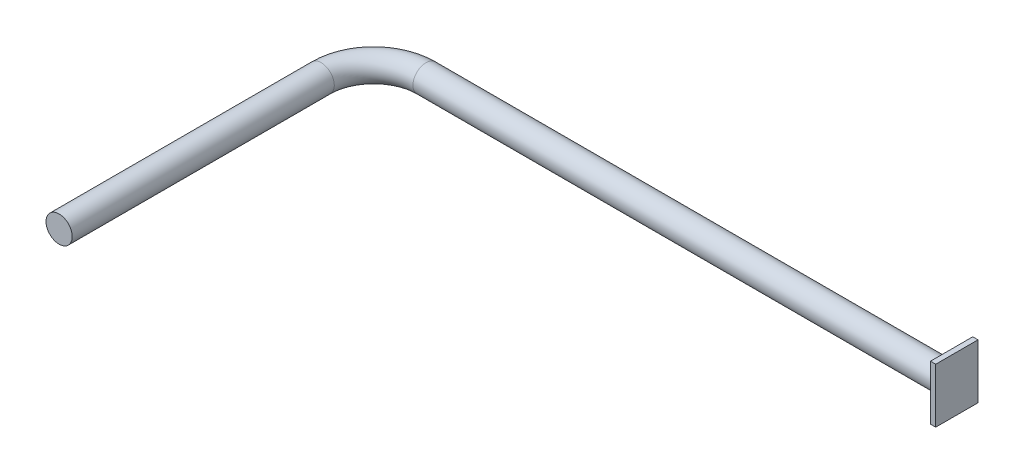
ISO-10303-21;
HEADER;
FILE_DESCRIPTION(('STEP AP214'),'2;1');
FILE_NAME('part.step','',(''),(''),'','','');
FILE_SCHEMA(('AUTOMOTIVE_DESIGN { 1 0 10303 214 1 1 1 1 }'));
ENDSEC;
DATA;
#1=APPLICATION_CONTEXT('core data for automotive mechanical design processes');
#2=APPLICATION_PROTOCOL_DEFINITION('international standard','automotive_design',2000,#1);
#3=PRODUCT_CONTEXT('',#1,'mechanical');
#4=PRODUCT('Part','Part','',(#3));
#5=PRODUCT_RELATED_PRODUCT_CATEGORY('part','',(#4));
#6=PRODUCT_DEFINITION_FORMATION('','',#4);
#7=PRODUCT_DEFINITION_CONTEXT('part definition',#1,'design');
#8=PRODUCT_DEFINITION('design','',#6,#7);
#9=PRODUCT_DEFINITION_SHAPE('','',#8);
#10=(LENGTH_UNIT() NAMED_UNIT(*) SI_UNIT(.MILLI.,.METRE.));
#11=(NAMED_UNIT(*) PLANE_ANGLE_UNIT() SI_UNIT($,.RADIAN.));
#12=(NAMED_UNIT(*) SI_UNIT($,.STERADIAN.) SOLID_ANGLE_UNIT());
#13=UNCERTAINTY_MEASURE_WITH_UNIT(LENGTH_MEASURE(1.E-05),#10,'distance_accuracy_value','');
#14=(GEOMETRIC_REPRESENTATION_CONTEXT(3) GLOBAL_UNCERTAINTY_ASSIGNED_CONTEXT((#13)) GLOBAL_UNIT_ASSIGNED_CONTEXT((#10,
#11,#12)) REPRESENTATION_CONTEXT('',''));
#15=CARTESIAN_POINT('',(0.,0.,0.));
#16=DIRECTION('',(0.,0.,1.));
#17=DIRECTION('',(1.,0.,0.));
#18=AXIS2_PLACEMENT_3D('',#15,#16,#17);
#19=CARTESIAN_POINT('',(0.,0.,0.));
#20=DIRECTION('',(0.,0.,1.));
#21=DIRECTION('',(1.,0.,0.));
#22=AXIS2_PLACEMENT_3D('',#19,#20,#21);
#23=PLANE('',#22);
#24=CARTESIAN_POINT('',(0.,0.,0.));
#25=DIRECTION('',(0.,0.,1.));
#26=DIRECTION('',(1.,0.,0.));
#27=AXIS2_PLACEMENT_3D('',#24,#25,#26);
#28=CIRCLE('',#27,25.);
#29=CARTESIAN_POINT('',(25.,0.,0.));
#30=VERTEX_POINT('',#29);
#31=EDGE_CURVE('E46',#30,#30,#28,.T.);
#32=ORIENTED_EDGE('',*,*,#31,.T.);
#33=EDGE_LOOP('',(#32));
#34=FACE_BOUND('',#33,.T.);
#35=ADVANCED_FACE('F33',(#34),#23,.T.);
#36=CARTESIAN_POINT('',(0.,0.,0.));
#37=DIRECTION('',(0.,0.,-1.));
#38=DIRECTION('',(-1.,0.,0.));
#39=AXIS2_PLACEMENT_3D('',#36,#37,#38);
#40=CYLINDRICAL_SURFACE('',#39,25.);
#41=CARTESIAN_POINT('',(0.,0.,-500.));
#42=DIRECTION('',(0.,0.,1.));
#43=DIRECTION('',(1.,0.,0.));
#44=AXIS2_PLACEMENT_3D('',#41,#42,#43);
#45=CIRCLE('',#44,25.);
#46=CARTESIAN_POINT('',(-25.,0.,-500.));
#47=VERTEX_POINT('',#46);
#48=EDGE_CURVE('E41',#47,#47,#45,.T.);
#49=ORIENTED_EDGE('',*,*,#48,.T.);
#50=EDGE_LOOP('',(#49));
#51=FACE_BOUND('',#50,.T.);
#52=ORIENTED_EDGE('',*,*,#31,.F.);
#53=EDGE_LOOP('',(#52));
#54=FACE_BOUND('',#53,.T.);
#55=ADVANCED_FACE('F120',(#51,#54),#40,.T.);
#56=CARTESIAN_POINT('',(100.,0.,-500.));
#57=DIRECTION('',(0.,-1.,0.));
#58=DIRECTION('',(0.,0.,-1.));
#59=AXIS2_PLACEMENT_3D('',#56,#57,#58);
#60=TOROIDAL_SURFACE('',#59,100.,25.);
#61=CARTESIAN_POINT('',(100.,0.,-600.));
#62=DIRECTION('',(-1.,0.,0.));
#63=DIRECTION('',(0.,0.,1.));
#64=AXIS2_PLACEMENT_3D('',#61,#62,#63);
#65=CIRCLE('',#64,25.);
#66=CARTESIAN_POINT('',(100.,0.,-625.));
#67=VERTEX_POINT('',#66);
#68=EDGE_CURVE('E11',#67,#67,#65,.T.);
#69=CARTESIAN_POINT('',(100.,0.,-500.));
#70=DIRECTION('',(0.,-1.,0.));
#71=DIRECTION('',(0.,0.,-1.));
#72=AXIS2_PLACEMENT_3D('',#69,#70,#71);
#73=CIRCLE('',#72,125.);
#74=EDGE_CURVE('',#47,#67,#73,.T.);
#75=ORIENTED_EDGE('',*,*,#48,.F.);
#76=ORIENTED_EDGE('',*,*,#68,.T.);
#77=ORIENTED_EDGE('',*,*,#74,.T.);
#78=ORIENTED_EDGE('',*,*,#74,.F.);
#79=EDGE_LOOP('',(#75,#77,#76,#78));
#80=FACE_BOUND('',#79,.T.);
#81=ADVANCED_FACE('F122',(#80),#60,.T.);
#82=CARTESIAN_POINT('',(100.,0.,-600.));
#83=DIRECTION('',(1.,0.,0.));
#84=DIRECTION('',(0.,0.,-1.));
#85=AXIS2_PLACEMENT_3D('',#82,#83,#84);
#86=CYLINDRICAL_SURFACE('',#85,25.);
#87=CARTESIAN_POINT('',(1100.,0.,-600.));
#88=DIRECTION('',(-1.,0.,0.));
#89=DIRECTION('',(0.,0.,1.));
#90=AXIS2_PLACEMENT_3D('',#87,#88,#89);
#91=CIRCLE('',#90,25.);
#92=CARTESIAN_POINT('',(1100.,0.,-575.));
#93=VERTEX_POINT('',#92);
#94=EDGE_CURVE('E36',#93,#93,#91,.T.);
#95=ORIENTED_EDGE('',*,*,#94,.T.);
#96=EDGE_LOOP('',(#95));
#97=FACE_BOUND('',#96,.T.);
#98=ORIENTED_EDGE('',*,*,#68,.F.);
#99=EDGE_LOOP('',(#98));
#100=FACE_BOUND('',#99,.T.);
#101=ADVANCED_FACE('F124',(#97,#100),#86,.T.);
#102=CARTESIAN_POINT('',(1110.,50.5096643071458,-562.497328388884));
#103=DIRECTION('',(0.,0.,-1.));
#104=DIRECTION('',(-1.,0.,0.));
#105=AXIS2_PLACEMENT_3D('',#102,#103,#104);
#106=PLANE('',#105);
#107=DIRECTION('',(0.,-1.,0.));
#108=VECTOR('',#107,1.);
#109=CARTESIAN_POINT('',(1100.,50.5096643071458,-562.497328388884));
#110=LINE('',#109,#108);
#111=CARTESIAN_POINT('',(1100.,50.5096643071458,-562.497328388884));
#112=VERTEX_POINT('',#111);
#113=CARTESIAN_POINT('',(1100.,-53.5708560833284,-562.497328388884));
#114=VERTEX_POINT('',#113);
#115=EDGE_CURVE('E106',#112,#114,#110,.T.);
#116=ORIENTED_EDGE('',*,*,#115,.T.);
#117=DIRECTION('',(-1.,0.,0.));
#118=VECTOR('',#117,1.);
#119=CARTESIAN_POINT('',(1110.,-53.5708560833284,-562.497328388884));
#120=LINE('',#119,#118);
#121=CARTESIAN_POINT('',(1110.,-53.5708560833284,-562.497328388884));
#122=VERTEX_POINT('',#121);
#123=EDGE_CURVE('E97',#122,#114,#120,.T.);
#124=ORIENTED_EDGE('',*,*,#123,.F.);
#125=DIRECTION('',(0.,-1.,0.));
#126=VECTOR('',#125,1.);
#127=CARTESIAN_POINT('',(1110.,50.5096643071458,-562.497328388884));
#128=LINE('',#127,#126);
#129=CARTESIAN_POINT('',(1110.,50.5096643071458,-562.497328388884));
#130=VERTEX_POINT('',#129);
#131=EDGE_CURVE('E88',#130,#122,#128,.T.);
#132=ORIENTED_EDGE('',*,*,#131,.F.);
#133=DIRECTION('',(-1.,0.,0.));
#134=VECTOR('',#133,1.);
#135=CARTESIAN_POINT('',(1110.,50.5096643071458,-562.497328388884));
#136=LINE('',#135,#134);
#137=EDGE_CURVE('E102',#130,#112,#136,.T.);
#138=ORIENTED_EDGE('',*,*,#137,.T.);
#139=EDGE_LOOP('',(#116,#124,#132,#138));
#140=FACE_BOUND('',#139,.T.);
#141=ADVANCED_FACE('F131',(#140),#106,.F.);
#142=CARTESIAN_POINT('',(1110.,-53.5708560833284,-562.497328388884));
#143=DIRECTION('',(0.,1.,0.));
#144=DIRECTION('',(0.,0.,1.));
#145=AXIS2_PLACEMENT_3D('',#142,#143,#144);
#146=PLANE('',#145);
#147=DIRECTION('',(0.,0.,-1.));
#148=VECTOR('',#147,1.);
#149=CARTESIAN_POINT('',(1100.,-53.5708560833284,-562.497328388884));
#150=LINE('',#149,#148);
#151=CARTESIAN_POINT('',(1100.,-53.5708560833284,-643.108711828565));
#152=VERTEX_POINT('',#151);
#153=EDGE_CURVE('E94',#114,#152,#150,.T.);
#154=ORIENTED_EDGE('',*,*,#153,.T.);
#155=DIRECTION('',(-1.,0.,0.));
#156=VECTOR('',#155,1.);
#157=CARTESIAN_POINT('',(1110.,-53.5708560833284,-643.108711828565));
#158=LINE('',#157,#156);
#159=CARTESIAN_POINT('',(1110.,-53.5708560833284,-643.108711828565));
#160=VERTEX_POINT('',#159);
#161=EDGE_CURVE('E92',#160,#152,#158,.T.);
#162=ORIENTED_EDGE('',*,*,#161,.F.);
#163=DIRECTION('',(0.,0.,-1.));
#164=VECTOR('',#163,1.);
#165=CARTESIAN_POINT('',(1110.,-53.5708560833284,-562.497328388884));
#166=LINE('',#165,#164);
#167=EDGE_CURVE('E82',#122,#160,#166,.T.);
#168=ORIENTED_EDGE('',*,*,#167,.F.);
#169=ORIENTED_EDGE('',*,*,#123,.T.);
#170=EDGE_LOOP('',(#154,#162,#168,#169));
#171=FACE_BOUND('',#170,.T.);
#172=ADVANCED_FACE('F93',(#171),#146,.F.);
#173=CARTESIAN_POINT('',(1110.,50.5096643071458,-643.108711828565));
#174=DIRECTION('',(0.,0.,1.));
#175=DIRECTION('',(1.,0.,0.));
#176=AXIS2_PLACEMENT_3D('',#173,#174,#175);
#177=PLANE('',#176);
#178=DIRECTION('',(0.,1.,0.));
#179=VECTOR('',#178,1.);
#180=CARTESIAN_POINT('',(1100.,50.5096643071458,-643.108711828565));
#181=LINE('',#180,#179);
#182=CARTESIAN_POINT('',(1100.,50.5096643071458,-643.108711828565));
#183=VERTEX_POINT('',#182);
#184=EDGE_CURVE('E110',#152,#183,#181,.T.);
#185=ORIENTED_EDGE('',*,*,#184,.T.);
#186=DIRECTION('',(-1.,0.,0.));
#187=VECTOR('',#186,1.);
#188=CARTESIAN_POINT('',(1110.,50.5096643071458,-643.108711828565));
#189=LINE('',#188,#187);
#190=CARTESIAN_POINT('',(1110.,50.5096643071458,-643.108711828565));
#191=VERTEX_POINT('',#190);
#192=EDGE_CURVE('E98',#191,#183,#189,.T.);
#193=ORIENTED_EDGE('',*,*,#192,.F.);
#194=DIRECTION('',(0.,1.,0.));
#195=VECTOR('',#194,1.);
#196=CARTESIAN_POINT('',(1110.,50.5096643071458,-643.108711828565));
#197=LINE('',#196,#195);
#198=EDGE_CURVE('E85',#160,#191,#197,.T.);
#199=ORIENTED_EDGE('',*,*,#198,.F.);
#200=ORIENTED_EDGE('',*,*,#161,.T.);
#201=EDGE_LOOP('',(#185,#193,#199,#200));
#202=FACE_BOUND('',#201,.T.);
#203=ADVANCED_FACE('F100',(#202),#177,.F.);
#204=CARTESIAN_POINT('',(1110.,50.5096643071458,-562.497328388884));
#205=DIRECTION('',(0.,-1.,0.));
#206=DIRECTION('',(0.,0.,-1.));
#207=AXIS2_PLACEMENT_3D('',#204,#205,#206);
#208=PLANE('',#207);
#209=DIRECTION('',(0.,0.,1.));
#210=VECTOR('',#209,1.);
#211=CARTESIAN_POINT('',(1100.,50.5096643071458,-562.497328388884));
#212=LINE('',#211,#210);
#213=EDGE_CURVE('E74',#183,#112,#212,.T.);
#214=ORIENTED_EDGE('',*,*,#213,.T.);
#215=ORIENTED_EDGE('',*,*,#137,.F.);
#216=DIRECTION('',(0.,0.,1.));
#217=VECTOR('',#216,1.);
#218=CARTESIAN_POINT('',(1110.,50.5096643071458,-562.497328388884));
#219=LINE('',#218,#217);
#220=EDGE_CURVE('E54',#191,#130,#219,.T.);
#221=ORIENTED_EDGE('',*,*,#220,.F.);
#222=ORIENTED_EDGE('',*,*,#192,.T.);
#223=EDGE_LOOP('',(#214,#215,#221,#222));
#224=FACE_BOUND('',#223,.T.);
#225=ADVANCED_FACE('F142',(#224),#208,.F.);
#226=CARTESIAN_POINT('',(1110.,0.,0.));
#227=DIRECTION('',(1.,0.,0.));
#228=DIRECTION('',(0.,0.,-1.));
#229=AXIS2_PLACEMENT_3D('',#226,#227,#228);
#230=PLANE('',#229);
#231=ORIENTED_EDGE('',*,*,#131,.T.);
#232=ORIENTED_EDGE('',*,*,#167,.T.);
#233=ORIENTED_EDGE('',*,*,#198,.T.);
#234=ORIENTED_EDGE('',*,*,#220,.T.);
#235=EDGE_LOOP('',(#231,#232,#233,#234));
#236=FACE_BOUND('',#235,.T.);
#237=ADVANCED_FACE('F83',(#236),#230,.T.);
#238=CARTESIAN_POINT('',(1100.,0.,0.));
#239=DIRECTION('',(1.,0.,0.));
#240=DIRECTION('',(0.,0.,-1.));
#241=AXIS2_PLACEMENT_3D('',#238,#239,#240);
#242=PLANE('',#241);
#243=ORIENTED_EDGE('',*,*,#94,.F.);
#244=EDGE_LOOP('',(#243));
#245=FACE_BOUND('',#244,.T.);
#246=ORIENTED_EDGE('',*,*,#115,.F.);
#247=ORIENTED_EDGE('',*,*,#213,.F.);
#248=ORIENTED_EDGE('',*,*,#184,.F.);
#249=ORIENTED_EDGE('',*,*,#153,.F.);
#250=EDGE_LOOP('',(#246,#247,#248,#249));
#251=FACE_BOUND('',#250,.T.);
#252=ADVANCED_FACE('F145',(#245,#251),#242,.F.);
#253=CLOSED_SHELL('',(#35,#55,#81,#101,#141,#172,#203,#225,#237,#252));
#254=MANIFOLD_SOLID_BREP('B2',#253);
#255=ADVANCED_BREP_SHAPE_REPRESENTATION('',(#18,#254),#14);
#256=SHAPE_DEFINITION_REPRESENTATION(#9,#255);
ENDSEC;
END-ISO-10303-21;
